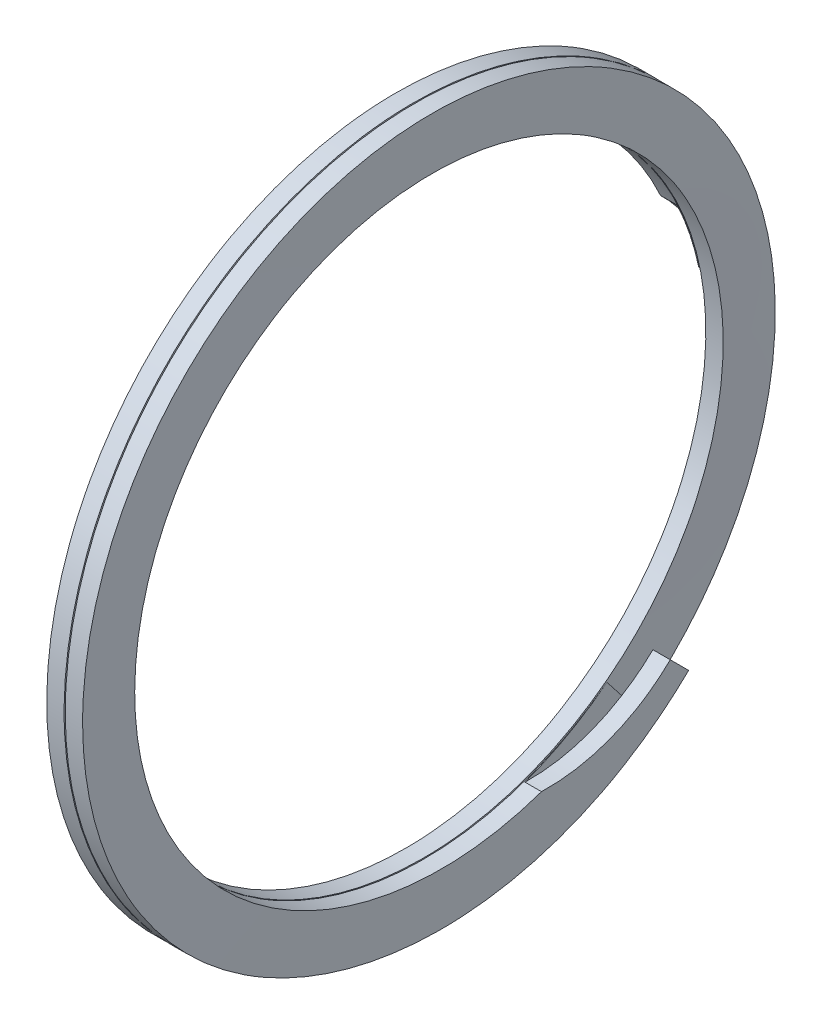
ISO-10303-21;
HEADER;
FILE_DESCRIPTION(('STEP AP214'),'2;1');
FILE_NAME('part.step','',(''),(''),'','','');
FILE_SCHEMA(('AUTOMOTIVE_DESIGN { 1 0 10303 214 1 1 1 1 }'));
ENDSEC;
DATA;
#1=APPLICATION_CONTEXT('core data for automotive mechanical design processes');
#2=APPLICATION_PROTOCOL_DEFINITION('international standard','automotive_design',2000,#1);
#3=PRODUCT_CONTEXT('',#1,'mechanical');
#4=PRODUCT('Part','Part','',(#3));
#5=PRODUCT_RELATED_PRODUCT_CATEGORY('part','',(#4));
#6=PRODUCT_DEFINITION_FORMATION('','',#4);
#7=PRODUCT_DEFINITION_CONTEXT('part definition',#1,'design');
#8=PRODUCT_DEFINITION('design','',#6,#7);
#9=PRODUCT_DEFINITION_SHAPE('','',#8);
#10=(LENGTH_UNIT() NAMED_UNIT(*) SI_UNIT(.MILLI.,.METRE.));
#11=(NAMED_UNIT(*) PLANE_ANGLE_UNIT() SI_UNIT($,.RADIAN.));
#12=(NAMED_UNIT(*) SI_UNIT($,.STERADIAN.) SOLID_ANGLE_UNIT());
#13=UNCERTAINTY_MEASURE_WITH_UNIT(LENGTH_MEASURE(1.E-05),#10,'distance_accuracy_value','');
#14=(GEOMETRIC_REPRESENTATION_CONTEXT(3) GLOBAL_UNCERTAINTY_ASSIGNED_CONTEXT((#13)) GLOBAL_UNIT_ASSIGNED_CONTEXT((#10,
#11,#12)) REPRESENTATION_CONTEXT('',''));
#15=CARTESIAN_POINT('',(0.,0.,0.));
#16=DIRECTION('',(0.,0.,1.));
#17=DIRECTION('',(1.,0.,0.));
#18=AXIS2_PLACEMENT_3D('',#15,#16,#17);
#19=CARTESIAN_POINT('',(0.211666666666667,0.,-3.6449));
#20=DIRECTION('',(0.,-1.,0.));
#21=DIRECTION('',(0.,0.,-1.));
#22=AXIS2_PLACEMENT_3D('',#19,#20,#21);
#23=PLANE('',#22);
#24=DIRECTION('',(0.,0.,-1.));
#25=VECTOR('',#24,1.);
#26=CARTESIAN_POINT('',(0.211666666666667,0.,-4.2799));
#27=LINE('',#26,#25);
#28=CARTESIAN_POINT('',(0.211666666666667,0.,-3.9624));
#29=VERTEX_POINT('',#28);
#30=CARTESIAN_POINT('',(0.211666666666667,0.,-4.2799));
#31=VERTEX_POINT('',#30);
#32=EDGE_CURVE('E268',#29,#31,#27,.T.);
#33=ORIENTED_EDGE('',*,*,#32,.F.);
#34=DIRECTION('',(-1.,0.,0.));
#35=VECTOR('',#34,1.);
#36=CARTESIAN_POINT('',(0.218723054599808,0.,-3.9624));
#37=LINE('',#36,#35);
#38=CARTESIAN_POINT('',(0.,0.,-3.9624));
#39=VERTEX_POINT('',#38);
#40=EDGE_CURVE('E186',#29,#39,#37,.T.);
#41=ORIENTED_EDGE('',*,*,#40,.T.);
#42=DIRECTION('',(0.,0.,1.));
#43=VECTOR('',#42,1.);
#44=CARTESIAN_POINT('',(0.,0.,-4.2799));
#45=LINE('',#44,#43);
#46=CARTESIAN_POINT('',(0.,0.,-4.2799));
#47=VERTEX_POINT('',#46);
#48=EDGE_CURVE('E265',#47,#39,#45,.T.);
#49=ORIENTED_EDGE('',*,*,#48,.F.);
#50=DIRECTION('',(-1.,0.,0.));
#51=VECTOR('',#50,1.);
#52=CARTESIAN_POINT('',(0.211666666666667,0.,-4.2799));
#53=LINE('',#52,#51);
#54=EDGE_CURVE('E282',#31,#47,#53,.T.);
#55=ORIENTED_EDGE('',*,*,#54,.F.);
#56=EDGE_LOOP('',(#33,#41,#49,#55));
#57=FACE_BOUND('',#56,.T.);
#58=ADVANCED_FACE('F32',(#57),#23,.T.);
#59=CARTESIAN_POINT('',(0.,0.,-4.2799));
#60=CARTESIAN_POINT('',(0.0188148148148148,2.47100141710468,-4.2799));
#61=CARTESIAN_POINT('',(0.0376296296296295,3.70650212565702,-2.13995));
#62=CARTESIAN_POINT('',(0.0564444444444443,4.94200283420936,0.));
#63=CARTESIAN_POINT('',(0.0752592592592591,3.70650212565702,2.13995));
#64=CARTESIAN_POINT('',(0.0940740740740739,2.47100141710468,4.2799));
#65=CARTESIAN_POINT('',(0.112888888888889,0.,4.2799));
#66=CARTESIAN_POINT('',(0.131703703703703,-2.47100141710468,4.2799));
#67=CARTESIAN_POINT('',(0.150518518518518,-3.70650212565702,2.13995));
#68=CARTESIAN_POINT('',(0.169333333333333,-4.94200283420936,0.));
#69=CARTESIAN_POINT('',(0.188148148148148,-3.70650212565702,-2.13995));
#70=CARTESIAN_POINT('',(0.206962962962963,-2.47100141710468,-4.2799));
#71=CARTESIAN_POINT('',(0.225777777777777,0.,-4.2799));
#72=CARTESIAN_POINT('',(0.244592592592592,2.47100141710468,-4.2799));
#73=CARTESIAN_POINT('',(0.263407407407407,3.70650212565702,-2.13995));
#74=CARTESIAN_POINT('',(0.282222222222222,4.94200283420936,0.));
#75=CARTESIAN_POINT('',(0.301037037037036,3.70650212565702,2.13995));
#76=CARTESIAN_POINT('',(0.319851851851851,2.47100141710468,4.2799));
#77=CARTESIAN_POINT('',(0.338666666666666,0.,4.2799));
#78=CARTESIAN_POINT('',(0.357481481481481,-2.47100141710468,4.2799));
#79=CARTESIAN_POINT('',(0.376296296296295,-3.70650212565702,2.13995));
#80=CARTESIAN_POINT('',(0.39511111111111,-4.94200283420936,0.));
#81=CARTESIAN_POINT('',(0.413925925925925,-3.70650212565702,-2.13995));
#82=CARTESIAN_POINT('',(0.43274074074074,-2.47100141710468,-4.2799));
#83=CARTESIAN_POINT('',(0.451555555555555,0.,-4.2799));
#84=CARTESIAN_POINT('',(0.,0.,-3.6449));
#85=CARTESIAN_POINT('',(0.0188148148148148,2.10438399616927,-3.6449));
#86=CARTESIAN_POINT('',(0.0376296296296295,3.1565759942539,-1.82245));
#87=CARTESIAN_POINT('',(0.0564444444444443,4.20876799233853,0.));
#88=CARTESIAN_POINT('',(0.0752592592592591,3.1565759942539,1.82245));
#89=CARTESIAN_POINT('',(0.0940740740740739,2.10438399616927,3.6449));
#90=CARTESIAN_POINT('',(0.112888888888889,0.,3.6449));
#91=CARTESIAN_POINT('',(0.131703703703703,-2.10438399616927,3.6449));
#92=CARTESIAN_POINT('',(0.150518518518518,-3.1565759942539,1.82245));
#93=CARTESIAN_POINT('',(0.169333333333333,-4.20876799233853,0.));
#94=CARTESIAN_POINT('',(0.188148148148148,-3.1565759942539,-1.82245));
#95=CARTESIAN_POINT('',(0.206962962962963,-2.10438399616927,-3.6449));
#96=CARTESIAN_POINT('',(0.225777777777777,0.,-3.6449));
#97=CARTESIAN_POINT('',(0.244592592592592,2.10438399616927,-3.6449));
#98=CARTESIAN_POINT('',(0.263407407407407,3.1565759942539,-1.82245));
#99=CARTESIAN_POINT('',(0.282222222222222,4.20876799233853,0.));
#100=CARTESIAN_POINT('',(0.301037037037036,3.1565759942539,1.82245));
#101=CARTESIAN_POINT('',(0.319851851851851,2.10438399616927,3.6449));
#102=CARTESIAN_POINT('',(0.338666666666666,0.,3.6449));
#103=CARTESIAN_POINT('',(0.357481481481481,-2.10438399616927,3.6449));
#104=CARTESIAN_POINT('',(0.376296296296295,-3.1565759942539,1.82245));
#105=CARTESIAN_POINT('',(0.39511111111111,-4.20876799233853,0.));
#106=CARTESIAN_POINT('',(0.413925925925925,-3.1565759942539,-1.82245));
#107=CARTESIAN_POINT('',(0.43274074074074,-2.10438399616927,-3.6449));
#108=CARTESIAN_POINT('',(0.451555555555555,0.,-3.6449));
#109=(BOUNDED_SURFACE() B_SPLINE_SURFACE(1,2,((#59,#60,#61,#62,#63,#64,#65,#66,#67,#68,#69,#70,
#71,#72,#73,#74,#75,#76,#77,#78,#79,#80,#81,#82,#83),(#84,#85,#86,#87,#88,#89,#90,#91,#92,#93,
#94,#95,#96,#97,#98,#99,#100,#101,#102,#103,#104,#105,#106,#107,#108)),.UNSPECIFIED.,.F.,.F.,
.F.) B_SPLINE_SURFACE_WITH_KNOTS((2,2),(3,2,2,2,2,2,2,2,2,2,2,2,3),(0.,1.),(0.,
0.0833333333333333,0.166666666666667,0.25,0.333333333333333,0.416666666666667,0.5,
0.583333333333333,0.666666666666667,0.75,0.833333333333333,0.916666666666667,1.),
.UNSPECIFIED.) GEOMETRIC_REPRESENTATION_ITEM() RATIONAL_B_SPLINE_SURFACE(((1.,0.866025403784439,
1.,0.866025403784439,1.,0.866025403784439,1.,0.866025403784439,1.,0.866025403784439,1.,
0.866025403784439,1.,0.866025403784439,1.,0.866025403784439,1.,0.866025403784439,1.,
0.866025403784439,1.,0.866025403784439,1.,0.866025403784439,1.),(1.,0.866025403784439,1.,
0.866025403784439,1.,0.866025403784439,1.,0.866025403784439,1.,0.866025403784439,1.,
0.866025403784439,1.,0.866025403784439,1.,0.866025403784439,1.,0.866025403784439,1.,
0.866025403784439,1.,0.866025403784439,1.,0.866025403784439,1.))) REPRESENTATION_ITEM('') SURFACE());
#110=CARTESIAN_POINT('',(0.423001483260436,-2.80183934489489,-2.80184047465154));
#111=CARTESIAN_POINT('',(0.422265259662275,-2.85874990165173,-2.74488922446194));
#112=CARTESIAN_POINT('',(0.421536201027388,-2.91212289801252,-2.68512099791456));
#113=CARTESIAN_POINT('',(0.42009241368416,-3.011793769942,-2.55995059210425));
#114=CARTESIAN_POINT('',(0.419377684975819,-3.05809164551069,-2.49454841284132));
#115=CARTESIAN_POINT('',(0.418670121230752,-3.10085196068333,-2.42632925722061));
#116=B_SPLINE_CURVE_WITH_KNOTS('',3,(#110,#111,#112,#113,#114,#115),.UNSPECIFIED.,.F.,.F.,(4,2,
4),(0.,0.240401835568636,0.480803671137271),.UNSPECIFIED.);
#117=CARTESIAN_POINT('',(0.423167408296884,-2.80183934489506,-2.80184047465167));
#118=VERTEX_POINT('',#117);
#119=CARTESIAN_POINT('',(0.418670121230754,-3.10085196068324,-2.42632925722075));
#120=VERTEX_POINT('',#119);
#121=EDGE_CURVE('E112',#118,#120,#116,.T.);
#122=DIRECTION('',(0.,0.70710678118653,0.707106781186565));
#123=VECTOR('',#122,1.);
#124=CARTESIAN_POINT('',(0.423333333333333,-3.02634631280023,-3.02634631280038));
#125=LINE('',#124,#123);
#126=CARTESIAN_POINT('',(0.423166653544208,-3.02634573159268,-3.02634689400751));
#127=VERTEX_POINT('',#126);
#128=EDGE_CURVE('E35',#127,#118,#125,.T.);
#129=CARTESIAN_POINT('',(0.,0.,-4.2799));
#130=CARTESIAN_POINT('',(0.0188148148148148,2.47100141710468,-4.2799));
#131=CARTESIAN_POINT('',(0.0376296296296295,3.70650212565702,-2.13995));
#132=CARTESIAN_POINT('',(0.0564444444444443,4.94200283420936,0.));
#133=CARTESIAN_POINT('',(0.0752592592592591,3.70650212565702,2.13995));
#134=CARTESIAN_POINT('',(0.0940740740740739,2.47100141710468,4.2799));
#135=CARTESIAN_POINT('',(0.112888888888889,0.,4.2799));
#136=CARTESIAN_POINT('',(0.131703703703703,-2.47100141710468,4.2799));
#137=CARTESIAN_POINT('',(0.150518518518518,-3.70650212565702,2.13995));
#138=CARTESIAN_POINT('',(0.169333333333333,-4.94200283420936,0.));
#139=CARTESIAN_POINT('',(0.188148148148148,-3.70650212565702,-2.13995));
#140=CARTESIAN_POINT('',(0.206962962962963,-2.47100141710468,-4.2799));
#141=CARTESIAN_POINT('',(0.225777777777777,0.,-4.2799));
#142=CARTESIAN_POINT('',(0.244592592592592,2.47100141710468,-4.2799));
#143=CARTESIAN_POINT('',(0.263407407407407,3.70650212565702,-2.13995));
#144=CARTESIAN_POINT('',(0.282222222222222,4.94200283420936,0.));
#145=CARTESIAN_POINT('',(0.301037037037036,3.70650212565702,2.13995));
#146=CARTESIAN_POINT('',(0.319851851851851,2.47100141710469,4.2799));
#147=CARTESIAN_POINT('',(0.338666666666666,0.,4.2799));
#148=CARTESIAN_POINT('',(0.357481481481481,-2.47100141710467,4.2799));
#149=CARTESIAN_POINT('',(0.376296296296295,-3.70650212565701,2.13995000000001));
#150=CARTESIAN_POINT('',(0.39511111111111,-4.94200283420936,0.));
#151=CARTESIAN_POINT('',(0.413925925925925,-3.70650212565702,-2.13995));
#152=CARTESIAN_POINT('',(0.43274074074074,-2.47100141710469,-4.2799));
#153=CARTESIAN_POINT('',(0.451555555555555,0.,-4.2799));
#154=(BOUNDED_CURVE() B_SPLINE_CURVE(2,(#129,#130,#131,#132,#133,#134,#135,#136,#137,#138,#139,
#140,#141,#142,#143,#144,#145,#146,#147,#148,#149,#150,#151,#152,#153),.UNSPECIFIED.,.F.,
.F.) B_SPLINE_CURVE_WITH_KNOTS((3,2,2,2,2,2,2,2,2,2,2,2,3),(0.,0.0833333333333333,
0.166666666666667,0.25,0.333333333333333,0.416666666666667,0.5,0.583333333333333,
0.666666666666667,0.75,0.833333333333333,0.916666666666667,1.),
.UNSPECIFIED.) CURVE() GEOMETRIC_REPRESENTATION_ITEM() RATIONAL_B_SPLINE_CURVE((1.,
0.866025403784439,1.,0.866025403784439,1.,0.866025403784439,1.,0.866025403784439,1.,
0.866025403784439,1.,0.866025403784439,1.,0.866025403784439,1.,0.866025403784439,1.,
0.866025403784439,1.,0.866025403784439,1.,0.866025403784439,1.,0.866025403784439,1.)) REPRESENTATION_ITEM(''));
#155=EDGE_CURVE('E253',#47,#127,#154,.T.);
#156=CARTESIAN_POINT('',(0.,0.,-3.9624));
#157=CARTESIAN_POINT('',(0.000492558075070298,0.0598881784527664,-3.96239919297999));
#158=CARTESIAN_POINT('',(0.000991295529970087,0.119746959306346,-3.95987228366598));
#159=CARTESIAN_POINT('',(0.00200074956409998,0.239038511381952,-3.94979083765118));
#160=CARTESIAN_POINT('',(0.00251146595828775,0.298471289166086,-3.94223637856322));
#161=CARTESIAN_POINT('',(0.00406054473618295,0.475526304460818,-3.91207801167167));
#162=CARTESIAN_POINT('',(0.00511630705589615,0.591963021991411,-3.88197906440642));
#163=CARTESIAN_POINT('',(0.00726480910737298,0.818131523401086,-3.80265596872895));
#164=CARTESIAN_POINT('',(0.00835757401922118,0.927858592899538,-3.75341854781536));
#165=CARTESIAN_POINT('',(0.0105714551522874,1.13736058928386,-3.63725244445667));
#166=CARTESIAN_POINT('',(0.0116925172411794,1.23715294400617,-3.57035552186063));
#167=CARTESIAN_POINT('',(0.0132724530633426,1.36763388960226,-3.46597969283102));
#168=CARTESIAN_POINT('',(0.013723289705415,1.40372831128908,-3.43506437451151));
#169=CARTESIAN_POINT('',(0.0146273257310359,1.473723479982,-3.37093398291946));
#170=CARTESIAN_POINT('',(0.0150805211186998,1.50762711360526,-3.33772206035838));
#171=CARTESIAN_POINT('',(0.0155351764950885,1.54040130221625,-3.30340125297311));
#172=B_SPLINE_CURVE_WITH_KNOTS('',3,(#156,#157,#158,#159,#160,#161,#162,#163,#164,#165,#166,
#167,#168,#169,#170,#171),.UNSPECIFIED.,.F.,.F.,(4,2,2,2,2,2,2,4),(0.,0.179559011557801,
0.359115251236997,0.718056531268284,1.07724718191628,1.43579619344862,1.57829182003555,
1.72059569346326),.UNSPECIFIED.);
#173=CARTESIAN_POINT('',(0.0155351764951249,1.54040130221865,-3.3034012529699));
#174=VERTEX_POINT('',#173);
#175=EDGE_CURVE('E184',#39,#174,#172,.T.);
#176=CARTESIAN_POINT('',(0.,0.,-3.6449));
#177=CARTESIAN_POINT('',(0.0188148148148148,2.10438399616927,-3.6449));
#178=CARTESIAN_POINT('',(0.0376296296296295,3.1565759942539,-1.82245));
#179=CARTESIAN_POINT('',(0.0564444444444443,4.20876799233853,0.));
#180=CARTESIAN_POINT('',(0.0752592592592591,3.1565759942539,1.82245));
#181=CARTESIAN_POINT('',(0.0940740740740739,2.10438399616927,3.6449));
#182=CARTESIAN_POINT('',(0.112888888888889,0.,3.6449));
#183=CARTESIAN_POINT('',(0.131703703703703,-2.10438399616927,3.6449));
#184=CARTESIAN_POINT('',(0.150518518518518,-3.1565759942539,1.82245));
#185=CARTESIAN_POINT('',(0.169333333333333,-4.20876799233853,0.));
#186=CARTESIAN_POINT('',(0.188148148148148,-3.1565759942539,-1.82245));
#187=CARTESIAN_POINT('',(0.206962962962963,-2.10438399616927,-3.6449));
#188=CARTESIAN_POINT('',(0.225777777777777,0.,-3.6449));
#189=CARTESIAN_POINT('',(0.244592592592592,2.10438399616926,-3.6449));
#190=CARTESIAN_POINT('',(0.263407407407407,3.1565759942539,-1.82245));
#191=CARTESIAN_POINT('',(0.282222222222222,4.20876799233853,0.));
#192=CARTESIAN_POINT('',(0.301037037037036,3.1565759942539,1.82245));
#193=CARTESIAN_POINT('',(0.319851851851851,2.10438399616927,3.6449));
#194=CARTESIAN_POINT('',(0.338666666666666,0.,3.6449));
#195=CARTESIAN_POINT('',(0.357481481481481,-2.10438399616926,3.6449));
#196=CARTESIAN_POINT('',(0.376296296296295,-3.1565759942539,1.82245));
#197=CARTESIAN_POINT('',(0.39511111111111,-4.20876799233853,0.));
#198=CARTESIAN_POINT('',(0.413925925925925,-3.1565759942539,-1.82245));
#199=CARTESIAN_POINT('',(0.43274074074074,-2.10438399616927,-3.6449));
#200=CARTESIAN_POINT('',(0.451555555555555,0.,-3.6449));
#201=(BOUNDED_CURVE() B_SPLINE_CURVE(2,(#176,#177,#178,#179,#180,#181,#182,#183,#184,#185,#186,
#187,#188,#189,#190,#191,#192,#193,#194,#195,#196,#197,#198,#199,#200),.UNSPECIFIED.,.F.,
.F.) B_SPLINE_CURVE_WITH_KNOTS((3,2,2,2,2,2,2,2,2,2,2,2,3),(0.,0.0833333333333333,
0.166666666666667,0.25,0.333333333333333,0.416666666666667,0.5,0.583333333333333,
0.666666666666667,0.75,0.833333333333333,0.916666666666667,1.),
.UNSPECIFIED.) CURVE() GEOMETRIC_REPRESENTATION_ITEM() RATIONAL_B_SPLINE_CURVE((1.,
0.866025403784439,1.,0.866025403784439,1.,0.866025403784439,1.,0.866025403784439,1.,
0.866025403784439,1.,0.866025403784439,1.,0.866025403784439,1.,0.866025403784439,1.,
0.866025403784439,1.,0.866025403784439,1.,0.866025403784439,1.,0.866025403784439,1.)) REPRESENTATION_ITEM(''));
#202=CARTESIAN_POINT('',(0.418670121230754,-2.87056767444991,-2.24613829414006));
#203=VERTEX_POINT('',#202);
#204=EDGE_CURVE('E260',#174,#203,#201,.T.);
#205=CARTESIAN_POINT('',(0.418670121230754,-3.3706665724378,-2.63745158580217));
#206=CARTESIAN_POINT('',(0.418670121230754,-3.32254453354201,-2.59979744675575));
#207=CARTESIAN_POINT('',(0.418670121230754,-3.27442249464623,-2.56214330770933));
#208=CARTESIAN_POINT('',(0.418670121230754,-3.17817841685466,-2.48683502961648));
#209=CARTESIAN_POINT('',(0.418670121230754,-3.13005637795888,-2.44918089057005));
#210=CARTESIAN_POINT('',(0.418670121230754,-3.01147878419206,-2.35639726572913));
#211=CARTESIAN_POINT('',(0.418670121230754,-2.94102322932103,-2.30126777993463));
#212=CARTESIAN_POINT('',(0.418670121230754,-2.87056767444999,-2.24613829414014));
#213=B_SPLINE_CURVE_WITH_KNOTS('',3,(#205,#206,#207,#208,#209,#210,#211,#212),.UNSPECIFIED.,.F.,
.F.,(4,2,2,4),(0.,0.183308710467706,0.366617420935413,0.635),.UNSPECIFIED.);
#214=EDGE_CURVE('E103',#120,#203,#213,.T.);
#215=ORIENTED_EDGE('',*,*,#121,.F.);
#216=ORIENTED_EDGE('',*,*,#128,.F.);
#217=ORIENTED_EDGE('',*,*,#155,.F.);
#218=ORIENTED_EDGE('',*,*,#48,.T.);
#219=ORIENTED_EDGE('',*,*,#175,.T.);
#220=ORIENTED_EDGE('',*,*,#204,.T.);
#221=ORIENTED_EDGE('',*,*,#214,.F.);
#222=EDGE_LOOP('',(#215,#216,#217,#218,#219,#220,#221));
#223=FACE_BOUND('',#222,.T.);
#224=ADVANCED_FACE('F155',(#223),#109,.T.);
#225=CARTESIAN_POINT('',(0.,0.,0.));
#226=DIRECTION('',(1.,0.,0.));
#227=DIRECTION('',(0.,0.,-1.));
#228=AXIS2_PLACEMENT_3D('',#225,#226,#227);
#229=CYLINDRICAL_SURFACE('',#228,3.6449);
#230=DIRECTION('',(1.,0.,0.));
#231=VECTOR('',#230,1.);
#232=CARTESIAN_POINT('',(0.418670121230754,-3.42508536817472,-1.2466299493894));
#233=LINE('',#232,#231);
#234=CARTESIAN_POINT('',(0.418670121230754,-3.42508536817472,-1.2466299493894));
#235=VERTEX_POINT('',#234);
#236=CARTESIAN_POINT('',(0.619647876622938,-3.42508536817472,-1.2466299493894));
#237=VERTEX_POINT('',#236);
#238=EDGE_CURVE('E108',#235,#237,#233,.T.);
#239=ORIENTED_EDGE('',*,*,#238,.F.);
#240=CARTESIAN_POINT('',(0.418670121230754,0.,0.));
#241=DIRECTION('',(-1.,0.,0.));
#242=DIRECTION('',(0.,0.,1.));
#243=AXIS2_PLACEMENT_3D('',#240,#241,#242);
#244=CIRCLE('',#243,3.64489999999989);
#245=EDGE_CURVE('E98',#203,#235,#244,.T.);
#246=ORIENTED_EDGE('',*,*,#245,.F.);
#247=ORIENTED_EDGE('',*,*,#204,.F.);
#248=DIRECTION('',(-1.,0.,0.));
#249=VECTOR('',#248,1.);
#250=CARTESIAN_POINT('',(0.218723054599808,1.54040130221865,-3.3034012529699));
#251=LINE('',#250,#249);
#252=CARTESIAN_POINT('',(0.218723054599808,1.54040130221865,-3.3034012529699));
#253=VERTEX_POINT('',#252);
#254=EDGE_CURVE('E189',#253,#174,#251,.T.);
#255=ORIENTED_EDGE('',*,*,#254,.F.);
#256=CARTESIAN_POINT('',(0.218723054599808,0.,0.));
#257=DIRECTION('',(-1.,0.,0.));
#258=DIRECTION('',(0.,0.,-1.));
#259=AXIS2_PLACEMENT_3D('',#256,#257,#258);
#260=CIRCLE('',#259,3.6449);
#261=CARTESIAN_POINT('',(0.218723054599808,0.744830708601911,-3.56798587798825));
#262=VERTEX_POINT('',#261);
#263=EDGE_CURVE('E190',#253,#262,#260,.T.);
#264=ORIENTED_EDGE('',*,*,#263,.T.);
#265=CARTESIAN_POINT('',(0.211666666666667,0.,-3.6449));
#266=CARTESIAN_POINT('',(0.230481481481482,2.10438399616927,-3.6449));
#267=CARTESIAN_POINT('',(0.249296296296296,3.1565759942539,-1.82245));
#268=CARTESIAN_POINT('',(0.268111111111111,4.20876799233853,0.));
#269=CARTESIAN_POINT('',(0.286925925925926,3.1565759942539,1.82245));
#270=CARTESIAN_POINT('',(0.305740740740741,2.10438399616927,3.6449));
#271=CARTESIAN_POINT('',(0.324555555555555,0.,3.6449));
#272=CARTESIAN_POINT('',(0.34337037037037,-2.10438399616927,3.6449));
#273=CARTESIAN_POINT('',(0.362185185185185,-3.1565759942539,1.82245));
#274=CARTESIAN_POINT('',(0.381,-4.20876799233853,0.));
#275=CARTESIAN_POINT('',(0.399814814814815,-3.1565759942539,-1.82245));
#276=CARTESIAN_POINT('',(0.418629629629629,-2.10438399616927,-3.6449));
#277=CARTESIAN_POINT('',(0.437444444444444,0.,-3.6449));
#278=CARTESIAN_POINT('',(0.456259259259259,2.10438399616926,-3.6449));
#279=CARTESIAN_POINT('',(0.475074074074074,3.1565759942539,-1.82245));
#280=CARTESIAN_POINT('',(0.493888888888888,4.20876799233853,0.));
#281=CARTESIAN_POINT('',(0.512703703703703,3.1565759942539,1.82245));
#282=CARTESIAN_POINT('',(0.531518518518518,2.10438399616927,3.6449));
#283=CARTESIAN_POINT('',(0.550333333333333,0.,3.6449));
#284=CARTESIAN_POINT('',(0.569148148148147,-2.10438399616926,3.6449));
#285=CARTESIAN_POINT('',(0.587962962962962,-3.1565759942539,1.82245));
#286=CARTESIAN_POINT('',(0.606777777777777,-4.20876799233853,0.));
#287=CARTESIAN_POINT('',(0.625592592592592,-3.1565759942539,-1.82245));
#288=CARTESIAN_POINT('',(0.644407407407407,-2.10438399616927,-3.6449));
#289=CARTESIAN_POINT('',(0.663222222222221,0.,-3.6449));
#290=(BOUNDED_CURVE() B_SPLINE_CURVE(2,(#265,#266,#267,#268,#269,#270,#271,#272,#273,#274,#275,
#276,#277,#278,#279,#280,#281,#282,#283,#284,#285,#286,#287,#288,#289),.UNSPECIFIED.,.F.,
.F.) B_SPLINE_CURVE_WITH_KNOTS((3,2,2,2,2,2,2,2,2,2,2,2,3),(0.,0.0833333333333333,
0.166666666666667,0.25,0.333333333333333,0.416666666666667,0.5,0.583333333333333,
0.666666666666667,0.75,0.833333333333333,0.916666666666667,1.),
.UNSPECIFIED.) CURVE() GEOMETRIC_REPRESENTATION_ITEM() RATIONAL_B_SPLINE_CURVE((1.,
0.866025403784439,1.,0.866025403784439,1.,0.866025403784439,1.,0.866025403784439,1.,
0.866025403784439,1.,0.866025403784439,1.,0.866025403784439,1.,0.866025403784439,1.,
0.866025403784439,1.,0.866025403784439,1.,0.866025403784439,1.,0.866025403784439,1.)) REPRESENTATION_ITEM(''));
#291=EDGE_CURVE('E118',#262,#237,#290,.T.);
#292=ORIENTED_EDGE('',*,*,#291,.T.);
#293=EDGE_LOOP('',(#239,#246,#247,#255,#264,#292));
#294=FACE_BOUND('',#293,.T.);
#295=ADVANCED_FACE('F115',(#294),#229,.F.);
#296=CARTESIAN_POINT('',(0.211666666666667,0.,-3.6449));
#297=CARTESIAN_POINT('',(0.230481481481482,2.10438399616927,-3.6449));
#298=CARTESIAN_POINT('',(0.249296296296296,3.1565759942539,-1.82245));
#299=CARTESIAN_POINT('',(0.268111111111111,4.20876799233853,0.));
#300=CARTESIAN_POINT('',(0.286925925925926,3.1565759942539,1.82245));
#301=CARTESIAN_POINT('',(0.305740740740741,2.10438399616927,3.6449));
#302=CARTESIAN_POINT('',(0.324555555555555,0.,3.6449));
#303=CARTESIAN_POINT('',(0.34337037037037,-2.10438399616927,3.6449));
#304=CARTESIAN_POINT('',(0.362185185185185,-3.1565759942539,1.82245));
#305=CARTESIAN_POINT('',(0.381,-4.20876799233853,0.));
#306=CARTESIAN_POINT('',(0.399814814814815,-3.1565759942539,-1.82245));
#307=CARTESIAN_POINT('',(0.418629629629629,-2.10438399616927,-3.6449));
#308=CARTESIAN_POINT('',(0.437444444444444,0.,-3.6449));
#309=CARTESIAN_POINT('',(0.456259259259259,2.10438399616927,-3.6449));
#310=CARTESIAN_POINT('',(0.475074074074074,3.1565759942539,-1.82245));
#311=CARTESIAN_POINT('',(0.493888888888888,4.20876799233853,0.));
#312=CARTESIAN_POINT('',(0.512703703703703,3.1565759942539,1.82245));
#313=CARTESIAN_POINT('',(0.531518518518518,2.10438399616927,3.6449));
#314=CARTESIAN_POINT('',(0.550333333333333,0.,3.6449));
#315=CARTESIAN_POINT('',(0.569148148148147,-2.10438399616927,3.6449));
#316=CARTESIAN_POINT('',(0.587962962962962,-3.1565759942539,1.82245));
#317=CARTESIAN_POINT('',(0.606777777777777,-4.20876799233853,0.));
#318=CARTESIAN_POINT('',(0.625592592592592,-3.1565759942539,-1.82245));
#319=CARTESIAN_POINT('',(0.644407407407407,-2.10438399616927,-3.6449));
#320=CARTESIAN_POINT('',(0.663222222222221,0.,-3.6449));
#321=CARTESIAN_POINT('',(0.211666666666667,0.,-4.2799));
#322=CARTESIAN_POINT('',(0.230481481481481,2.47100141710468,-4.2799));
#323=CARTESIAN_POINT('',(0.249296296296296,3.70650212565702,-2.13995));
#324=CARTESIAN_POINT('',(0.268111111111111,4.94200283420936,0.));
#325=CARTESIAN_POINT('',(0.286925925925926,3.70650212565702,2.13995));
#326=CARTESIAN_POINT('',(0.305740740740741,2.47100141710468,4.2799));
#327=CARTESIAN_POINT('',(0.324555555555555,0.,4.2799));
#328=CARTESIAN_POINT('',(0.34337037037037,-2.47100141710468,4.2799));
#329=CARTESIAN_POINT('',(0.362185185185185,-3.70650212565702,2.13995));
#330=CARTESIAN_POINT('',(0.381,-4.94200283420936,0.));
#331=CARTESIAN_POINT('',(0.399814814814814,-3.70650212565702,-2.13995));
#332=CARTESIAN_POINT('',(0.418629629629629,-2.47100141710468,-4.2799));
#333=CARTESIAN_POINT('',(0.437444444444444,0.,-4.2799));
#334=CARTESIAN_POINT('',(0.456259259259259,2.47100141710468,-4.2799));
#335=CARTESIAN_POINT('',(0.475074074074073,3.70650212565702,-2.13995));
#336=CARTESIAN_POINT('',(0.493888888888888,4.94200283420936,0.));
#337=CARTESIAN_POINT('',(0.512703703703703,3.70650212565702,2.13995));
#338=CARTESIAN_POINT('',(0.531518518518518,2.47100141710468,4.2799));
#339=CARTESIAN_POINT('',(0.550333333333333,0.,4.2799));
#340=CARTESIAN_POINT('',(0.569148148148147,-2.47100141710468,4.2799));
#341=CARTESIAN_POINT('',(0.587962962962962,-3.70650212565702,2.13995));
#342=CARTESIAN_POINT('',(0.606777777777777,-4.94200283420936,0.));
#343=CARTESIAN_POINT('',(0.625592592592592,-3.70650212565702,-2.13995));
#344=CARTESIAN_POINT('',(0.644407407407406,-2.47100141710468,-4.2799));
#345=CARTESIAN_POINT('',(0.663222222222221,0.,-4.2799));
#346=(BOUNDED_SURFACE() B_SPLINE_SURFACE(1,2,((#296,#297,#298,#299,#300,#301,#302,#303,#304,
#305,#306,#307,#308,#309,#310,#311,#312,#313,#314,#315,#316,#317,#318,#319,#320),(#321,#322,
#323,#324,#325,#326,#327,#328,#329,#330,#331,#332,#333,#334,#335,#336,#337,#338,#339,#340,#341,
#342,#343,#344,#345)),.UNSPECIFIED.,.F.,.F.,.F.) B_SPLINE_SURFACE_WITH_KNOTS((2,2),(3,2,2,2,2,2,
2,2,2,2,2,2,3),(0.,1.),(0.,0.0833333333333333,0.166666666666667,0.25,0.333333333333333,
0.416666666666667,0.5,0.583333333333333,0.666666666666667,0.75,0.833333333333333,
0.916666666666667,1.),
.UNSPECIFIED.) GEOMETRIC_REPRESENTATION_ITEM() RATIONAL_B_SPLINE_SURFACE(((1.,0.866025403784439,
1.,0.866025403784439,1.,0.866025403784439,1.,0.866025403784439,1.,0.866025403784439,1.,
0.866025403784439,1.,0.866025403784439,1.,0.866025403784439,1.,0.866025403784439,1.,
0.866025403784439,1.,0.866025403784439,1.,0.866025403784439,1.),(1.,0.866025403784439,1.,
0.866025403784439,1.,0.866025403784439,1.,0.866025403784439,1.,0.866025403784439,1.,
0.866025403784439,1.,0.866025403784439,1.,0.866025403784439,1.,0.866025403784439,1.,
0.866025403784439,1.,0.866025403784439,1.,0.866025403784439,1.))) REPRESENTATION_ITEM('') SURFACE());
#347=CARTESIAN_POINT('',(0.619647876622938,-3.42508536817483,-1.24662994938944));
#348=CARTESIAN_POINT('',(0.620189366315452,-3.42647394612004,-1.3064842057005));
#349=CARTESIAN_POINT('',(0.620724879639738,-3.42532709508744,-1.36639449667281));
#350=CARTESIAN_POINT('',(0.621784457725481,-3.41799721779823,-1.48590550098149));
#351=CARTESIAN_POINT('',(0.622308522662955,-3.41181426902693,-1.54550621906675));
#352=CARTESIAN_POINT('',(0.623345950915385,-3.39444313307466,-1.66400412818974));
#353=CARTESIAN_POINT('',(0.623859309464255,-3.38325276453666,-1.72290100112229));
#354=CARTESIAN_POINT('',(0.624867563283266,-3.35595704869931,-1.83952669929445));
#355=CARTESIAN_POINT('',(0.625362459394431,-3.33985192559098,-1.89725557768513));
#356=CARTESIAN_POINT('',(0.626859984407643,-3.28429233306224,-2.0681522397466));
#357=CARTESIAN_POINT('',(0.627875622095991,-3.2375904777819,-2.17905147894781));
#358=CARTESIAN_POINT('',(0.629950230505176,-3.12628463042373,-2.39122645445902));
#359=CARTESIAN_POINT('',(0.631009120564875,-3.06171277156117,-2.4925190302317));
#360=CARTESIAN_POINT('',(0.632509094587917,-2.96037927664127,-2.62536915323308));
#361=CARTESIAN_POINT('',(0.632937961800414,-2.9303066198693,-2.66216735048589));
#362=CARTESIAN_POINT('',(0.633799808604058,-2.86781167503265,-2.73362390472333));
#363=CARTESIAN_POINT('',(0.63423278188555,-2.83539260285885,-2.76828507426092));
#364=CARTESIAN_POINT('',(0.634668149927102,-2.80183934489531,-2.8018404746519));
#365=B_SPLINE_CURVE_WITH_KNOTS('',3,(#347,#348,#349,#350,#351,#352,#353,#354,#355,#356,#357,
#358,#359,#360,#361,#362,#363,#364),.UNSPECIFIED.,.F.,.F.,(4,2,2,2,2,2,2,2,4),(0.,
0.179560334049802,0.359117905440132,0.538753772853358,0.718381447237439,1.07757264116742,
1.43612210036958,1.57861216723011,1.72091051257257),.UNSPECIFIED.);
#366=CARTESIAN_POINT('',(0.634834083266145,-2.80183955220601,-2.80184139709475));
#367=VERTEX_POINT('',#366);
#368=EDGE_CURVE('E49',#237,#367,#365,.T.);
#369=CARTESIAN_POINT('',(0.218723054599808,0.82799157726831,-3.96635399248218));
#370=CARTESIAN_POINT('',(0.218723054599808,0.814131432490574,-3.89995930673319));
#371=CARTESIAN_POINT('',(0.218723054599808,0.800271287712839,-3.8335646209842));
#372=CARTESIAN_POINT('',(0.218723054599808,0.772550998157371,-3.70077524948623));
#373=CARTESIAN_POINT('',(0.218723054599808,0.758690853379638,-3.63438056373724));
#374=CARTESIAN_POINT('',(0.218723054599808,0.744830708601906,-3.56798587798825));
#375=B_SPLINE_CURVE_WITH_KNOTS('',3,(#369,#370,#371,#372,#373,#374),.UNSPECIFIED.,.F.,.F.,(4,2,
4),(0.,0.203477814959519,0.406955629919037),.UNSPECIFIED.);
#376=CARTESIAN_POINT('',(0.218723054599808,0.795028751514587,-3.8084511355919));
#377=VERTEX_POINT('',#376);
#378=EDGE_CURVE('E232',#377,#262,#375,.T.);
#379=CARTESIAN_POINT('',(0.218723054599701,0.795028751492587,-3.80845113560075));
#380=CARTESIAN_POINT('',(0.218177256601618,0.739047670721964,-3.83098349989329));
#381=CARTESIAN_POINT('',(0.217635886074334,0.68210408312033,-3.85112405526808));
#382=CARTESIAN_POINT('',(0.216562723820087,0.56668763548479,-3.88651215048347));
#383=CARTESIAN_POINT('',(0.216030936566179,0.508214091035755,-3.90175745855285));
#384=CARTESIAN_POINT('',(0.214986482609714,0.391117892688073,-3.92702368263213));
#385=CARTESIAN_POINT('',(0.214473646547887,0.332512200623177,-3.93712335854625));
#386=CARTESIAN_POINT('',(0.213459557623644,0.214689832912712,-3.95238331360232));
#387=CARTESIAN_POINT('',(0.212958298311513,0.155473525426252,-3.95754641115262));
#388=CARTESIAN_POINT('',(0.212195872479627,0.0641215826500489,-3.96167666333353));
#389=CARTESIAN_POINT('',(0.211930324920311,0.0320584107504667,-3.96240140869997));
#390=CARTESIAN_POINT('',(0.211666666666667,0.,-3.9624));
#391=B_SPLINE_CURVE_WITH_KNOTS('',3,(#379,#380,#381,#382,#383,#384,#385,#386,#387,#388,#389,
#390),.UNSPECIFIED.,.F.,.F.,(4,2,2,2,2,4),(0.,0.180990118311429,0.362062634280022,
0.540273427591159,0.718382415320047,0.814565156722771),.UNSPECIFIED.);
#392=EDGE_CURVE('E41',#377,#29,#391,.T.);
#393=CARTESIAN_POINT('',(0.211666666666667,0.,-4.2799));
#394=CARTESIAN_POINT('',(0.230481481481481,2.47100141710468,-4.2799));
#395=CARTESIAN_POINT('',(0.249296296296296,3.70650212565702,-2.13995));
#396=CARTESIAN_POINT('',(0.268111111111111,4.94200283420936,0.));
#397=CARTESIAN_POINT('',(0.286925925925926,3.70650212565702,2.13995));
#398=CARTESIAN_POINT('',(0.305740740740741,2.47100141710468,4.2799));
#399=CARTESIAN_POINT('',(0.324555555555555,0.,4.2799));
#400=CARTESIAN_POINT('',(0.34337037037037,-2.47100141710468,4.2799));
#401=CARTESIAN_POINT('',(0.362185185185185,-3.70650212565702,2.13995));
#402=CARTESIAN_POINT('',(0.381,-4.94200283420936,0.));
#403=CARTESIAN_POINT('',(0.399814814814814,-3.70650212565702,-2.13995));
#404=CARTESIAN_POINT('',(0.418629629629629,-2.47100141710468,-4.2799));
#405=CARTESIAN_POINT('',(0.437444444444444,0.,-4.2799));
#406=CARTESIAN_POINT('',(0.456259259259259,2.47100141710468,-4.2799));
#407=CARTESIAN_POINT('',(0.475074074074073,3.70650212565702,-2.13995));
#408=CARTESIAN_POINT('',(0.493888888888888,4.94200283420936,0.));
#409=CARTESIAN_POINT('',(0.512703703703703,3.70650212565702,2.13995));
#410=CARTESIAN_POINT('',(0.531518518518518,2.47100141710469,4.2799));
#411=CARTESIAN_POINT('',(0.550333333333333,0.,4.2799));
#412=CARTESIAN_POINT('',(0.569148148148147,-2.47100141710467,4.2799));
#413=CARTESIAN_POINT('',(0.587962962962962,-3.70650212565701,2.13995000000001));
#414=CARTESIAN_POINT('',(0.606777777777777,-4.94200283420936,0.));
#415=CARTESIAN_POINT('',(0.625592592592592,-3.70650212565702,-2.13995));
#416=CARTESIAN_POINT('',(0.644407407407406,-2.47100141710469,-4.2799));
#417=CARTESIAN_POINT('',(0.663222222222221,0.,-4.2799));
#418=(BOUNDED_CURVE() B_SPLINE_CURVE(2,(#393,#394,#395,#396,#397,#398,#399,#400,#401,#402,#403,
#404,#405,#406,#407,#408,#409,#410,#411,#412,#413,#414,#415,#416,#417),.UNSPECIFIED.,.F.,
.F.) B_SPLINE_CURVE_WITH_KNOTS((3,2,2,2,2,2,2,2,2,2,2,2,3),(0.,0.0833333333333333,
0.166666666666667,0.25,0.333333333333333,0.416666666666667,0.5,0.583333333333333,
0.666666666666667,0.75,0.833333333333333,0.916666666666667,1.),
.UNSPECIFIED.) CURVE() GEOMETRIC_REPRESENTATION_ITEM() RATIONAL_B_SPLINE_CURVE((1.,
0.866025403784439,1.,0.866025403784439,1.,0.866025403784439,1.,0.866025403784439,1.,
0.866025403784439,1.,0.866025403784439,1.,0.866025403784439,1.,0.866025403784439,1.,
0.866025403784439,1.,0.866025403784439,1.,0.866025403784439,1.,0.866025403784439,1.)) REPRESENTATION_ITEM(''));
#419=CARTESIAN_POINT('',(0.634842882097667,-3.02634562642316,-3.02634699917696));
#420=VERTEX_POINT('',#419);
#421=EDGE_CURVE('E275',#31,#420,#418,.T.);
#422=DIRECTION('',(0.,-0.70710678118653,-0.707106781186565));
#423=VECTOR('',#422,1.);
#424=CARTESIAN_POINT('',(0.635,-3.02634631280023,-3.02634631280038));
#425=LINE('',#424,#423);
#426=EDGE_CURVE('E197',#367,#420,#425,.T.);
#427=ORIENTED_EDGE('',*,*,#368,.F.);
#428=ORIENTED_EDGE('',*,*,#291,.F.);
#429=ORIENTED_EDGE('',*,*,#378,.F.);
#430=ORIENTED_EDGE('',*,*,#392,.T.);
#431=ORIENTED_EDGE('',*,*,#32,.T.);
#432=ORIENTED_EDGE('',*,*,#421,.T.);
#433=ORIENTED_EDGE('',*,*,#426,.F.);
#434=EDGE_LOOP('',(#427,#428,#429,#430,#431,#432,#433));
#435=FACE_BOUND('',#434,.T.);
#436=ADVANCED_FACE('F130',(#435),#346,.T.);
#437=CARTESIAN_POINT('',(0.635,-2.57733350674678,-2.57733350674691));
#438=DIRECTION('',(0.,-0.707106781186565,0.70710678118653));
#439=DIRECTION('',(0.,-0.70710678118653,-0.707106781186565));
#440=AXIS2_PLACEMENT_3D('',#437,#438,#439);
#441=PLANE('',#440);
#442=ORIENTED_EDGE('',*,*,#128,.T.);
#443=DIRECTION('',(1.,0.,0.));
#444=VECTOR('',#443,1.);
#445=CARTESIAN_POINT('',(0.418670121230754,-2.80183990977329,-2.80183990977344));
#446=LINE('',#445,#444);
#447=EDGE_CURVE('E11',#118,#367,#446,.T.);
#448=ORIENTED_EDGE('',*,*,#447,.T.);
#449=ORIENTED_EDGE('',*,*,#426,.T.);
#450=DIRECTION('',(-1.,0.,0.));
#451=VECTOR('',#450,1.);
#452=CARTESIAN_POINT('',(0.635,-3.02634631280023,-3.02634631280038));
#453=LINE('',#452,#451);
#454=EDGE_CURVE('E224',#420,#127,#453,.T.);
#455=ORIENTED_EDGE('',*,*,#454,.T.);
#456=EDGE_LOOP('',(#442,#448,#449,#455));
#457=FACE_BOUND('',#456,.T.);
#458=ADVANCED_FACE('F209',(#457),#441,.F.);
#459=CARTESIAN_POINT('',(0.,0.,0.));
#460=DIRECTION('',(1.,0.,0.));
#461=DIRECTION('',(0.,0.,-1.));
#462=AXIS2_PLACEMENT_3D('',#459,#460,#461);
#463=CYLINDRICAL_SURFACE('',#462,4.2799);
#464=ORIENTED_EDGE('',*,*,#454,.F.);
#465=ORIENTED_EDGE('',*,*,#421,.F.);
#466=ORIENTED_EDGE('',*,*,#54,.T.);
#467=ORIENTED_EDGE('',*,*,#155,.T.);
#468=EDGE_LOOP('',(#464,#465,#466,#467));
#469=FACE_BOUND('',#468,.T.);
#470=ADVANCED_FACE('F217',(#469),#463,.T.);
#471=CARTESIAN_POINT('',(0.218723054599808,0.,-1.83256626881694));
#472=DIRECTION('',(-1.,0.,0.));
#473=DIRECTION('',(0.,0.,1.));
#474=AXIS2_PLACEMENT_3D('',#471,#472,#473);
#475=CYLINDRICAL_SURFACE('',#474,2.12983373118306);
#476=ORIENTED_EDGE('',*,*,#40,.F.);
#477=ORIENTED_EDGE('',*,*,#392,.F.);
#478=CARTESIAN_POINT('',(0.218723054599808,0.,-1.83256626881694));
#479=DIRECTION('',(1.,0.,0.));
#480=DIRECTION('',(0.,0.,-1.));
#481=AXIS2_PLACEMENT_3D('',#478,#479,#480);
#482=CIRCLE('',#481,2.12983373118306);
#483=EDGE_CURVE('E56',#377,#253,#482,.T.);
#484=ORIENTED_EDGE('',*,*,#483,.T.);
#485=ORIENTED_EDGE('',*,*,#254,.T.);
#486=ORIENTED_EDGE('',*,*,#175,.F.);
#487=EDGE_LOOP('',(#476,#477,#484,#485,#486));
#488=FACE_BOUND('',#487,.T.);
#489=ADVANCED_FACE('F161',(#488),#475,.F.);
#490=CARTESIAN_POINT('',(0.218723054599808,0.,-1.83256626881694));
#491=DIRECTION('',(1.,0.,0.));
#492=DIRECTION('',(0.,0.,-1.));
#493=AXIS2_PLACEMENT_3D('',#490,#491,#492);
#494=PLANE('',#493);
#495=ORIENTED_EDGE('',*,*,#378,.T.);
#496=ORIENTED_EDGE('',*,*,#263,.F.);
#497=ORIENTED_EDGE('',*,*,#483,.F.);
#498=EDGE_LOOP('',(#495,#496,#497));
#499=FACE_BOUND('',#498,.T.);
#500=ADVANCED_FACE('F140',(#499),#494,.F.);
#501=CARTESIAN_POINT('',(0.418670121230754,-1.29581975985693,-1.29582031145108));
#502=DIRECTION('',(1.,0.,0.));
#503=DIRECTION('',(0.,0.,-1.));
#504=AXIS2_PLACEMENT_3D('',#501,#502,#503);
#505=CYLINDRICAL_SURFACE('',#504,2.12983373118306);
#506=ORIENTED_EDGE('',*,*,#121,.T.);
#507=CARTESIAN_POINT('',(0.418670121230754,-1.29581975985693,-1.29582031145108));
#508=DIRECTION('',(1.,0.,0.));
#509=DIRECTION('',(0.,0.,1.));
#510=AXIS2_PLACEMENT_3D('',#507,#508,#509);
#511=CIRCLE('',#510,2.12983373118306);
#512=EDGE_CURVE('E101',#235,#120,#511,.T.);
#513=ORIENTED_EDGE('',*,*,#512,.F.);
#514=ORIENTED_EDGE('',*,*,#238,.T.);
#515=ORIENTED_EDGE('',*,*,#368,.T.);
#516=ORIENTED_EDGE('',*,*,#447,.F.);
#517=EDGE_LOOP('',(#506,#513,#514,#515,#516));
#518=FACE_BOUND('',#517,.T.);
#519=ADVANCED_FACE('F110',(#518),#505,.F.);
#520=CARTESIAN_POINT('',(0.418670121230754,-1.29581975985693,-1.29582031145108));
#521=DIRECTION('',(-1.,0.,0.));
#522=DIRECTION('',(0.,0.,1.));
#523=AXIS2_PLACEMENT_3D('',#520,#521,#522);
#524=PLANE('',#523);
#525=ORIENTED_EDGE('',*,*,#214,.T.);
#526=ORIENTED_EDGE('',*,*,#245,.T.);
#527=ORIENTED_EDGE('',*,*,#512,.T.);
#528=EDGE_LOOP('',(#525,#526,#527));
#529=FACE_BOUND('',#528,.T.);
#530=ADVANCED_FACE('F100',(#529),#524,.F.);
#531=CLOSED_SHELL('',(#58,#224,#295,#436,#458,#470,#489,#500,#519,#530));
#532=MANIFOLD_SOLID_BREP('B2',#531);
#533=ADVANCED_BREP_SHAPE_REPRESENTATION('',(#18,#532),#14);
#534=SHAPE_DEFINITION_REPRESENTATION(#9,#533);
ENDSEC;
END-ISO-10303-21;
